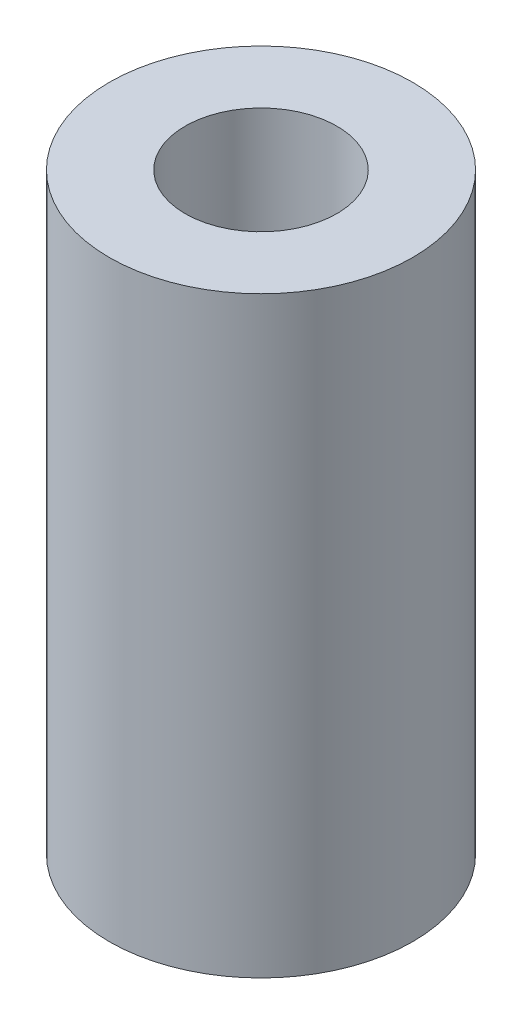
ISO-10303-21;
HEADER;
FILE_DESCRIPTION(('STEP AP214'),'2;1');
FILE_NAME('part.step','',(''),(''),'','','');
FILE_SCHEMA(('AUTOMOTIVE_DESIGN { 1 0 10303 214 1 1 1 1 }'));
ENDSEC;
DATA;
#1=APPLICATION_CONTEXT('core data for automotive mechanical design processes');
#2=APPLICATION_PROTOCOL_DEFINITION('international standard','automotive_design',2000,#1);
#3=PRODUCT_CONTEXT('',#1,'mechanical');
#4=PRODUCT('Part','Part','',(#3));
#5=PRODUCT_RELATED_PRODUCT_CATEGORY('part','',(#4));
#6=PRODUCT_DEFINITION_FORMATION('','',#4);
#7=PRODUCT_DEFINITION_CONTEXT('part definition',#1,'design');
#8=PRODUCT_DEFINITION('design','',#6,#7);
#9=PRODUCT_DEFINITION_SHAPE('','',#8);
#10=(LENGTH_UNIT() NAMED_UNIT(*) SI_UNIT(.MILLI.,.METRE.));
#11=(NAMED_UNIT(*) PLANE_ANGLE_UNIT() SI_UNIT($,.RADIAN.));
#12=(NAMED_UNIT(*) SI_UNIT($,.STERADIAN.) SOLID_ANGLE_UNIT());
#13=UNCERTAINTY_MEASURE_WITH_UNIT(LENGTH_MEASURE(1.E-05),#10,'distance_accuracy_value','');
#14=(GEOMETRIC_REPRESENTATION_CONTEXT(3) GLOBAL_UNCERTAINTY_ASSIGNED_CONTEXT((#13)) GLOBAL_UNIT_ASSIGNED_CONTEXT((#10,
#11,#12)) REPRESENTATION_CONTEXT('',''));
#15=CARTESIAN_POINT('',(0.,0.,0.));
#16=DIRECTION('',(0.,0.,1.));
#17=DIRECTION('',(1.,0.,0.));
#18=AXIS2_PLACEMENT_3D('',#15,#16,#17);
#19=CARTESIAN_POINT('',(0.,24.79999612,0.));
#20=DIRECTION('',(0.,-1.,0.));
#21=DIRECTION('',(0.,0.,-1.));
#22=AXIS2_PLACEMENT_3D('',#19,#20,#21);
#23=CYLINDRICAL_SURFACE('',#22,6.35);
#24=CARTESIAN_POINT('',(0.,24.79999612,0.));
#25=DIRECTION('',(0.,1.,0.));
#26=DIRECTION('',(0.,0.,1.));
#27=AXIS2_PLACEMENT_3D('',#24,#25,#26);
#28=CIRCLE('',#27,6.35);
#29=CARTESIAN_POINT('',(0.,24.79999612,6.35));
#30=VERTEX_POINT('',#29);
#31=EDGE_CURVE('E10',#30,#30,#28,.T.);
#32=ORIENTED_EDGE('',*,*,#31,.F.);
#33=EDGE_LOOP('',(#32));
#34=FACE_BOUND('',#33,.T.);
#35=CARTESIAN_POINT('',(0.,0.,0.));
#36=DIRECTION('',(0.,1.,0.));
#37=DIRECTION('',(0.,0.,1.));
#38=AXIS2_PLACEMENT_3D('',#35,#36,#37);
#39=CIRCLE('',#38,6.35);
#40=CARTESIAN_POINT('',(0.,0.,6.35));
#41=VERTEX_POINT('',#40);
#42=EDGE_CURVE('E33',#41,#41,#39,.T.);
#43=ORIENTED_EDGE('',*,*,#42,.T.);
#44=EDGE_LOOP('',(#43));
#45=FACE_BOUND('',#44,.T.);
#46=ADVANCED_FACE('F30',(#34,#45),#23,.T.);
#47=CARTESIAN_POINT('',(0.,24.79999612,0.));
#48=DIRECTION('',(0.,1.,0.));
#49=DIRECTION('',(0.,0.,1.));
#50=AXIS2_PLACEMENT_3D('',#47,#48,#49);
#51=PLANE('',#50);
#52=CARTESIAN_POINT('',(0.,24.79999612,0.));
#53=DIRECTION('',(0.,1.,0.));
#54=DIRECTION('',(0.,0.,1.));
#55=AXIS2_PLACEMENT_3D('',#52,#53,#54);
#56=CIRCLE('',#55,3.175);
#57=CARTESIAN_POINT('',(0.,24.79999612,3.175));
#58=VERTEX_POINT('',#57);
#59=EDGE_CURVE('E42',#58,#58,#56,.T.);
#60=ORIENTED_EDGE('',*,*,#59,.F.);
#61=EDGE_LOOP('',(#60));
#62=FACE_BOUND('',#61,.T.);
#63=ORIENTED_EDGE('',*,*,#31,.T.);
#64=EDGE_LOOP('',(#63));
#65=FACE_BOUND('',#64,.T.);
#66=ADVANCED_FACE('F57',(#62,#65),#51,.T.);
#67=CARTESIAN_POINT('',(0.,0.,0.));
#68=DIRECTION('',(0.,1.,0.));
#69=DIRECTION('',(0.,0.,1.));
#70=AXIS2_PLACEMENT_3D('',#67,#68,#69);
#71=PLANE('',#70);
#72=ORIENTED_EDGE('',*,*,#42,.F.);
#73=EDGE_LOOP('',(#72));
#74=FACE_BOUND('',#73,.T.);
#75=ADVANCED_FACE('F53',(#74),#71,.F.);
#76=CARTESIAN_POINT('',(0.,6.19999612,0.));
#77=DIRECTION('',(0.,1.,0.));
#78=DIRECTION('',(0.,0.,1.));
#79=AXIS2_PLACEMENT_3D('',#76,#77,#78);
#80=CYLINDRICAL_SURFACE('',#79,3.175);
#81=CARTESIAN_POINT('',(0.,6.19999612,0.));
#82=DIRECTION('',(0.,1.,0.));
#83=DIRECTION('',(0.,0.,1.));
#84=AXIS2_PLACEMENT_3D('',#81,#82,#83);
#85=CIRCLE('',#84,3.175);
#86=CARTESIAN_POINT('',(0.,6.19999612,3.175));
#87=VERTEX_POINT('',#86);
#88=EDGE_CURVE('E40',#87,#87,#85,.T.);
#89=ORIENTED_EDGE('',*,*,#88,.F.);
#90=EDGE_LOOP('',(#89));
#91=FACE_BOUND('',#90,.T.);
#92=ORIENTED_EDGE('',*,*,#59,.T.);
#93=EDGE_LOOP('',(#92));
#94=FACE_BOUND('',#93,.T.);
#95=ADVANCED_FACE('F50',(#91,#94),#80,.F.);
#96=CARTESIAN_POINT('',(0.,6.19999612,0.));
#97=DIRECTION('',(0.,1.,0.));
#98=DIRECTION('',(0.,0.,1.));
#99=AXIS2_PLACEMENT_3D('',#96,#97,#98);
#100=PLANE('',#99);
#101=ORIENTED_EDGE('',*,*,#88,.T.);
#102=EDGE_LOOP('',(#101));
#103=FACE_BOUND('',#102,.T.);
#104=ADVANCED_FACE('F48',(#103),#100,.T.);
#105=CLOSED_SHELL('',(#46,#66,#75,#95,#104));
#106=MANIFOLD_SOLID_BREP('B2',#105);
#107=ADVANCED_BREP_SHAPE_REPRESENTATION('',(#18,#106),#14);
#108=SHAPE_DEFINITION_REPRESENTATION(#9,#107);
ENDSEC;
END-ISO-10303-21;
